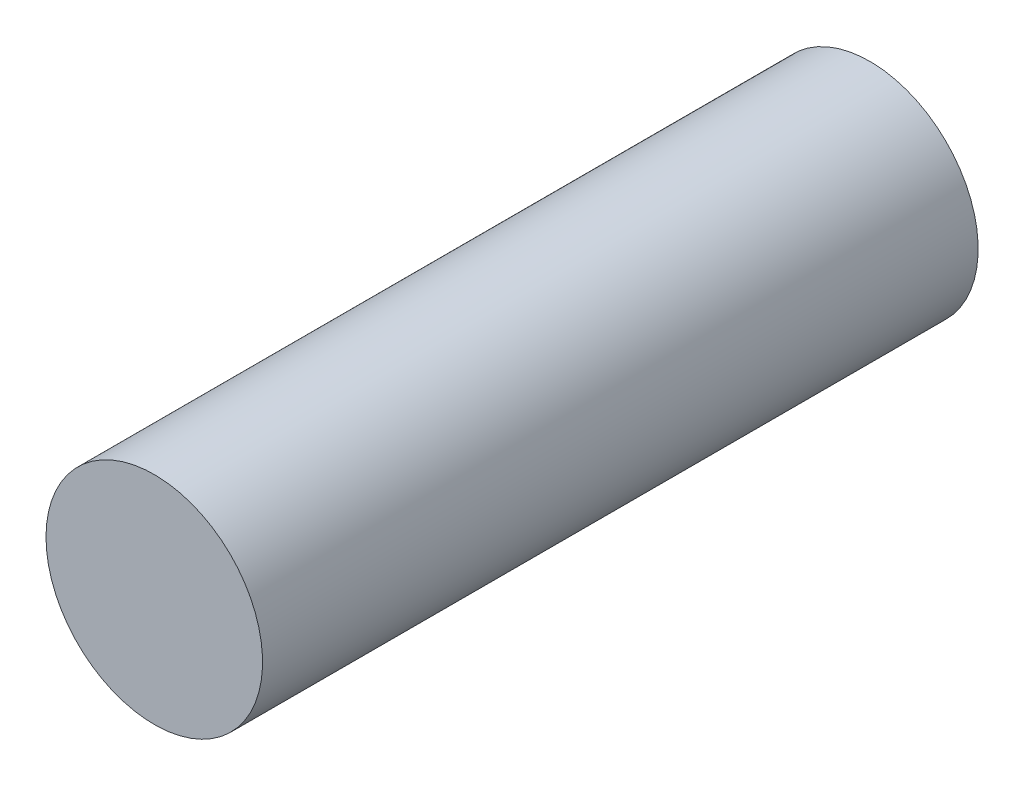
ISO-10303-21;
HEADER;
FILE_DESCRIPTION(('STEP AP214'),'2;1');
FILE_NAME('part.step','',(''),(''),'','','');
FILE_SCHEMA(('AUTOMOTIVE_DESIGN { 1 0 10303 214 1 1 1 1 }'));
ENDSEC;
DATA;
#1=APPLICATION_CONTEXT('core data for automotive mechanical design processes');
#2=APPLICATION_PROTOCOL_DEFINITION('international standard','automotive_design',2000,#1);
#3=PRODUCT_CONTEXT('',#1,'mechanical');
#4=PRODUCT('Part','Part','',(#3));
#5=PRODUCT_RELATED_PRODUCT_CATEGORY('part','',(#4));
#6=PRODUCT_DEFINITION_FORMATION('','',#4);
#7=PRODUCT_DEFINITION_CONTEXT('part definition',#1,'design');
#8=PRODUCT_DEFINITION('design','',#6,#7);
#9=PRODUCT_DEFINITION_SHAPE('','',#8);
#10=(LENGTH_UNIT() NAMED_UNIT(*) SI_UNIT(.MILLI.,.METRE.));
#11=(NAMED_UNIT(*) PLANE_ANGLE_UNIT() SI_UNIT($,.RADIAN.));
#12=(NAMED_UNIT(*) SI_UNIT($,.STERADIAN.) SOLID_ANGLE_UNIT());
#13=UNCERTAINTY_MEASURE_WITH_UNIT(LENGTH_MEASURE(1.E-05),#10,'distance_accuracy_value','');
#14=(GEOMETRIC_REPRESENTATION_CONTEXT(3) GLOBAL_UNCERTAINTY_ASSIGNED_CONTEXT((#13)) GLOBAL_UNIT_ASSIGNED_CONTEXT((#10,
#11,#12)) REPRESENTATION_CONTEXT('',''));
#15=CARTESIAN_POINT('',(0.,0.,0.));
#16=DIRECTION('',(0.,0.,1.));
#17=DIRECTION('',(1.,0.,0.));
#18=AXIS2_PLACEMENT_3D('',#15,#16,#17);
#19=CARTESIAN_POINT('',(0.,0.,-60.325));
#20=DIRECTION('',(0.,0.,1.));
#21=DIRECTION('',(-1.,0.,0.));
#22=AXIS2_PLACEMENT_3D('',#19,#20,#21);
#23=CYLINDRICAL_SURFACE('',#22,18.25625);
#24=CARTESIAN_POINT('',(0.,0.,-60.325));
#25=DIRECTION('',(0.,0.,1.));
#26=DIRECTION('',(1.,0.,0.));
#27=AXIS2_PLACEMENT_3D('',#24,#25,#26);
#28=CIRCLE('',#27,18.25625);
#29=CARTESIAN_POINT('',(-18.25625,0.,-60.325));
#30=VERTEX_POINT('',#29);
#31=EDGE_CURVE('E10',#30,#30,#28,.T.);
#32=CARTESIAN_POINT('',(0.,0.,60.325));
#33=DIRECTION('',(0.,0.,1.));
#34=DIRECTION('',(1.,0.,0.));
#35=AXIS2_PLACEMENT_3D('',#32,#33,#34);
#36=CIRCLE('',#35,18.25625);
#37=CARTESIAN_POINT('',(-18.25625,0.,60.325));
#38=VERTEX_POINT('',#37);
#39=EDGE_CURVE('E40',#38,#38,#36,.T.);
#40=CARTESIAN_POINT('',(-18.25625,0.,-60.325));
#41=CARTESIAN_POINT('',(-18.25625,0.,-59.0682291666667));
#42=CARTESIAN_POINT('',(-18.25625,0.,-57.8114583333333));
#43=CARTESIAN_POINT('',(-18.25625,0.,-55.2979166666667));
#44=CARTESIAN_POINT('',(-18.25625,0.,-54.0411458333333));
#45=CARTESIAN_POINT('',(-18.25625,0.,-51.5276041666667));
#46=CARTESIAN_POINT('',(-18.25625,0.,-50.2708333333333));
#47=CARTESIAN_POINT('',(-18.25625,0.,-47.7572916666667));
#48=CARTESIAN_POINT('',(-18.25625,0.,-46.5005208333333));
#49=CARTESIAN_POINT('',(-18.25625,0.,-43.9869791666667));
#50=CARTESIAN_POINT('',(-18.25625,0.,-42.7302083333333));
#51=CARTESIAN_POINT('',(-18.25625,0.,-40.2166666666667));
#52=CARTESIAN_POINT('',(-18.25625,0.,-38.9598958333333));
#53=CARTESIAN_POINT('',(-18.25625,0.,-36.4463541666667));
#54=CARTESIAN_POINT('',(-18.25625,0.,-35.1895833333333));
#55=CARTESIAN_POINT('',(-18.25625,0.,-32.6760416666667));
#56=CARTESIAN_POINT('',(-18.25625,0.,-31.4192708333333));
#57=CARTESIAN_POINT('',(-18.25625,0.,-28.9057291666667));
#58=CARTESIAN_POINT('',(-18.25625,0.,-27.6489583333333));
#59=CARTESIAN_POINT('',(-18.25625,0.,-25.1354166666667));
#60=CARTESIAN_POINT('',(-18.25625,0.,-23.8786458333333));
#61=CARTESIAN_POINT('',(-18.25625,0.,-21.3651041666667));
#62=CARTESIAN_POINT('',(-18.25625,0.,-20.1083333333333));
#63=CARTESIAN_POINT('',(-18.25625,0.,-17.5947916666667));
#64=CARTESIAN_POINT('',(-18.25625,0.,-16.3380208333333));
#65=CARTESIAN_POINT('',(-18.25625,0.,-13.8244791666667));
#66=CARTESIAN_POINT('',(-18.25625,0.,-12.5677083333333));
#67=CARTESIAN_POINT('',(-18.25625,0.,-10.0541666666667));
#68=CARTESIAN_POINT('',(-18.25625,0.,-8.79739583333334));
#69=CARTESIAN_POINT('',(-18.25625,0.,-6.28385416666667));
#70=CARTESIAN_POINT('',(-18.25625,0.,-5.02708333333334));
#71=CARTESIAN_POINT('',(-18.25625,0.,-2.51354166666667));
#72=CARTESIAN_POINT('',(-18.25625,0.,-1.25677083333334));
#73=CARTESIAN_POINT('',(-18.25625,0.,1.25677083333333));
#74=CARTESIAN_POINT('',(-18.25625,0.,2.51354166666666));
#75=CARTESIAN_POINT('',(-18.25625,0.,5.02708333333332));
#76=CARTESIAN_POINT('',(-18.25625,0.,6.28385416666666));
#77=CARTESIAN_POINT('',(-18.25625,0.,8.79739583333333));
#78=CARTESIAN_POINT('',(-18.25625,0.,10.0541666666667));
#79=CARTESIAN_POINT('',(-18.25625,0.,12.5677083333333));
#80=CARTESIAN_POINT('',(-18.25625,0.,13.8244791666667));
#81=CARTESIAN_POINT('',(-18.25625,0.,16.3380208333333));
#82=CARTESIAN_POINT('',(-18.25625,0.,17.5947916666667));
#83=CARTESIAN_POINT('',(-18.25625,0.,20.1083333333333));
#84=CARTESIAN_POINT('',(-18.25625,0.,21.3651041666667));
#85=CARTESIAN_POINT('',(-18.25625,0.,23.8786458333333));
#86=CARTESIAN_POINT('',(-18.25625,0.,25.1354166666667));
#87=CARTESIAN_POINT('',(-18.25625,0.,27.6489583333333));
#88=CARTESIAN_POINT('',(-18.25625,0.,28.9057291666667));
#89=CARTESIAN_POINT('',(-18.25625,0.,31.4192708333333));
#90=CARTESIAN_POINT('',(-18.25625,0.,32.6760416666667));
#91=CARTESIAN_POINT('',(-18.25625,0.,35.1895833333333));
#92=CARTESIAN_POINT('',(-18.25625,0.,36.4463541666667));
#93=CARTESIAN_POINT('',(-18.25625,0.,38.9598958333333));
#94=CARTESIAN_POINT('',(-18.25625,0.,40.2166666666667));
#95=CARTESIAN_POINT('',(-18.25625,0.,42.7302083333333));
#96=CARTESIAN_POINT('',(-18.25625,0.,43.9869791666667));
#97=CARTESIAN_POINT('',(-18.25625,0.,46.5005208333333));
#98=CARTESIAN_POINT('',(-18.25625,0.,47.7572916666667));
#99=CARTESIAN_POINT('',(-18.25625,0.,50.2708333333333));
#100=CARTESIAN_POINT('',(-18.25625,0.,51.5276041666667));
#101=CARTESIAN_POINT('',(-18.25625,0.,54.0411458333333));
#102=CARTESIAN_POINT('',(-18.25625,0.,55.2979166666667));
#103=CARTESIAN_POINT('',(-18.25625,0.,57.8114583333333));
#104=CARTESIAN_POINT('',(-18.25625,0.,59.0682291666667));
#105=CARTESIAN_POINT('',(-18.25625,0.,60.325));
#106=B_SPLINE_CURVE_WITH_KNOTS('',3,(#40,#41,#42,#43,#44,#45,#46,#47,#48,#49,#50,#51,#52,#53,
#54,#55,#56,#57,#58,#59,#60,#61,#62,#63,#64,#65,#66,#67,#68,#69,#70,#71,#72,#73,#74,#75,#76,#77,
#78,#79,#80,#81,#82,#83,#84,#85,#86,#87,#88,#89,#90,#91,#92,#93,#94,#95,#96,#97,#98,#99,#100,
#101,#102,#103,#104,#105),.UNSPECIFIED.,.F.,.F.,(4,2,2,2,2,2,2,2,2,2,2,2,2,2,2,2,2,2,2,2,2,2,2,
2,2,2,2,2,2,2,2,2,4),(0.,3.7703125,7.540625,11.3109375,15.08125,18.8515625,22.621875,26.3921875,
30.1625,33.9328125,37.703125,41.4734375,45.24375,49.0140625,52.784375,56.5546875,60.325,
64.0953125,67.865625,71.6359375,75.40625,79.1765625,82.946875,86.7171875,90.4875,94.2578125,
98.028125,101.7984375,105.56875,109.3390625,113.109375,116.8796875,120.65),.UNSPECIFIED.);
#107=EDGE_CURVE('BSEAM37',#30,#38,#106,.T.);
#108=ORIENTED_EDGE('',*,*,#31,.T.);
#109=ORIENTED_EDGE('',*,*,#39,.F.);
#110=ORIENTED_EDGE('',*,*,#107,.T.);
#111=ORIENTED_EDGE('',*,*,#107,.F.);
#112=EDGE_LOOP('',(#108,#110,#109,#111));
#113=FACE_BOUND('',#112,.T.);
#114=ADVANCED_FACE('F37',(#113),#23,.T.);
#115=CARTESIAN_POINT('',(0.,0.,-60.325));
#116=DIRECTION('',(0.,0.,-1.));
#117=DIRECTION('',(1.,0.,0.));
#118=AXIS2_PLACEMENT_3D('',#115,#116,#117);
#119=PLANE('',#118);
#120=ORIENTED_EDGE('',*,*,#31,.F.);
#121=EDGE_LOOP('',(#120));
#122=FACE_BOUND('',#121,.T.);
#123=ADVANCED_FACE('F52',(#122),#119,.T.);
#124=CARTESIAN_POINT('',(0.,0.,60.325));
#125=DIRECTION('',(0.,0.,-1.));
#126=DIRECTION('',(1.,0.,0.));
#127=AXIS2_PLACEMENT_3D('',#124,#125,#126);
#128=PLANE('',#127);
#129=ORIENTED_EDGE('',*,*,#39,.T.);
#130=EDGE_LOOP('',(#129));
#131=FACE_BOUND('',#130,.T.);
#132=ADVANCED_FACE('F49',(#131),#128,.F.);
#133=CLOSED_SHELL('',(#114,#123,#132));
#134=MANIFOLD_SOLID_BREP('B2',#133);
#135=ADVANCED_BREP_SHAPE_REPRESENTATION('',(#18,#134),#14);
#136=SHAPE_DEFINITION_REPRESENTATION(#9,#135);
ENDSEC;
END-ISO-10303-21;
